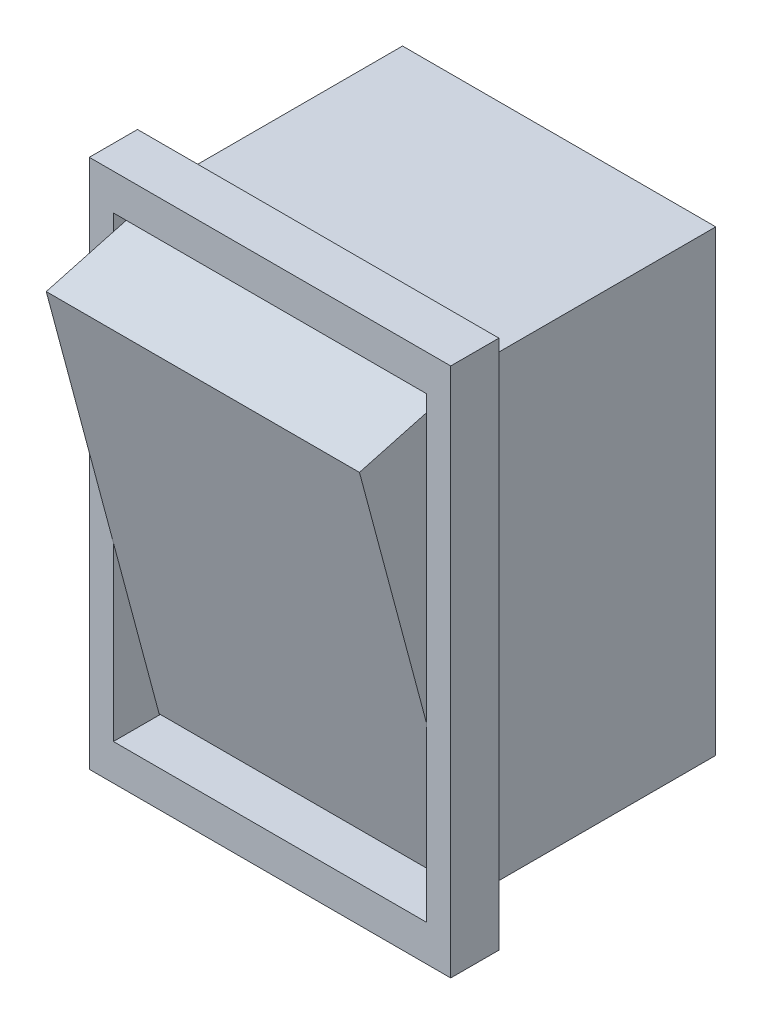
ISO-10303-21;
HEADER;
FILE_DESCRIPTION(('STEP AP214'),'2;1');
FILE_NAME('part.step','',(''),(''),'','','');
FILE_SCHEMA(('AUTOMOTIVE_DESIGN { 1 0 10303 214 1 1 1 1 }'));
ENDSEC;
DATA;
#1=APPLICATION_CONTEXT('core data for automotive mechanical design processes');
#2=APPLICATION_PROTOCOL_DEFINITION('international standard','automotive_design',2000,#1);
#3=PRODUCT_CONTEXT('',#1,'mechanical');
#4=PRODUCT('Part','Part','',(#3));
#5=PRODUCT_RELATED_PRODUCT_CATEGORY('part','',(#4));
#6=PRODUCT_DEFINITION_FORMATION('','',#4);
#7=PRODUCT_DEFINITION_CONTEXT('part definition',#1,'design');
#8=PRODUCT_DEFINITION('design','',#6,#7);
#9=PRODUCT_DEFINITION_SHAPE('','',#8);
#10=(LENGTH_UNIT() NAMED_UNIT(*) SI_UNIT(.MILLI.,.METRE.));
#11=(NAMED_UNIT(*) PLANE_ANGLE_UNIT() SI_UNIT($,.RADIAN.));
#12=(NAMED_UNIT(*) SI_UNIT($,.STERADIAN.) SOLID_ANGLE_UNIT());
#13=UNCERTAINTY_MEASURE_WITH_UNIT(LENGTH_MEASURE(1.E-05),#10,'distance_accuracy_value','');
#14=(GEOMETRIC_REPRESENTATION_CONTEXT(3) GLOBAL_UNCERTAINTY_ASSIGNED_CONTEXT((#13)) GLOBAL_UNIT_ASSIGNED_CONTEXT((#10,
#11,#12)) REPRESENTATION_CONTEXT('',''));
#15=CARTESIAN_POINT('',(0.,0.,0.));
#16=DIRECTION('',(0.,0.,1.));
#17=DIRECTION('',(1.,0.,0.));
#18=AXIS2_PLACEMENT_3D('',#15,#16,#17);
#19=CARTESIAN_POINT('',(-6.5,-9.5,12.));
#20=DIRECTION('',(1.,0.,0.));
#21=DIRECTION('',(0.,0.,-1.));
#22=AXIS2_PLACEMENT_3D('',#19,#20,#21);
#23=PLANE('',#22);
#24=DIRECTION('',(0.,1.,0.));
#25=VECTOR('',#24,1.);
#26=CARTESIAN_POINT('',(-6.5,-9.45001228834442,10.1028242124548));
#27=LINE('',#26,#25);
#28=CARTESIAN_POINT('',(-6.5,-9.45001228834442,10.1028242124548));
#29=VERTEX_POINT('',#28);
#30=CARTESIAN_POINT('',(-6.5,9.33792134068453,10.1028242124548));
#31=VERTEX_POINT('',#30);
#32=EDGE_CURVE('E153',#29,#31,#27,.T.);
#33=ORIENTED_EDGE('',*,*,#32,.F.);
#34=DIRECTION('',(0.,-0.966054260124425,-0.258339246912755));
#35=VECTOR('',#34,1.);
#36=CARTESIAN_POINT('',(-6.5,8.06740304725563,14.787277324927));
#37=LINE('',#36,#35);
#38=CARTESIAN_POINT('',(-6.5,-2.3555627470331,12.));
#39=VERTEX_POINT('',#38);
#40=EDGE_CURVE('E163',#39,#29,#37,.T.);
#41=ORIENTED_EDGE('',*,*,#40,.F.);
#42=DIRECTION('',(0.,-1.,0.));
#43=VECTOR('',#42,1.);
#44=CARTESIAN_POINT('',(-6.5,-9.5,12.));
#45=LINE('',#44,#43);
#46=CARTESIAN_POINT('',(-6.5,-9.5,12.));
#47=VERTEX_POINT('',#46);
#48=EDGE_CURVE('E180',#39,#47,#45,.T.);
#49=ORIENTED_EDGE('',*,*,#48,.T.);
#50=DIRECTION('',(0.,0.,-1.));
#51=VECTOR('',#50,1.);
#52=CARTESIAN_POINT('',(-6.5,-9.5,12.));
#53=LINE('',#52,#51);
#54=CARTESIAN_POINT('',(-6.5,-9.5,10.));
#55=VERTEX_POINT('',#54);
#56=EDGE_CURVE('E209',#47,#55,#53,.T.);
#57=ORIENTED_EDGE('',*,*,#56,.T.);
#58=DIRECTION('',(0.,-1.,0.));
#59=VECTOR('',#58,1.);
#60=CARTESIAN_POINT('',(-6.5,-9.5,10.));
#61=LINE('',#60,#59);
#62=CARTESIAN_POINT('',(-6.5,9.5,10.));
#63=VERTEX_POINT('',#62);
#64=EDGE_CURVE('E190',#63,#55,#61,.T.);
#65=ORIENTED_EDGE('',*,*,#64,.F.);
#66=DIRECTION('',(0.,0.,-1.));
#67=VECTOR('',#66,1.);
#68=CARTESIAN_POINT('',(-6.5,9.5,12.));
#69=LINE('',#68,#67);
#70=CARTESIAN_POINT('',(-6.5,9.5,12.));
#71=VERTEX_POINT('',#70);
#72=EDGE_CURVE('E189',#71,#63,#69,.T.);
#73=ORIENTED_EDGE('',*,*,#72,.F.);
#74=CARTESIAN_POINT('',(-6.5,8.82336895088497,12.));
#75=VERTEX_POINT('',#74);
#76=EDGE_CURVE('E162',#71,#75,#45,.T.);
#77=ORIENTED_EDGE('',*,*,#76,.T.);
#78=DIRECTION('',(0.,-0.261763317111545,0.965132097598438));
#79=VECTOR('',#78,1.);
#80=CARTESIAN_POINT('',(-6.5,9.33792134068453,10.1028242124548));
#81=LINE('',#80,#79);
#82=EDGE_CURVE('E145',#31,#75,#81,.T.);
#83=ORIENTED_EDGE('',*,*,#82,.F.);
#84=EDGE_LOOP('',(#33,#41,#49,#57,#65,#73,#77,#83));
#85=FACE_BOUND('',#84,.T.);
#86=ADVANCED_FACE('F49',(#85),#23,.T.);
#87=CARTESIAN_POINT('',(6.5,-9.5,12.));
#88=DIRECTION('',(-1.,0.,0.));
#89=DIRECTION('',(0.,0.,1.));
#90=AXIS2_PLACEMENT_3D('',#87,#88,#89);
#91=PLANE('',#90);
#92=DIRECTION('',(0.,1.,0.));
#93=VECTOR('',#92,1.);
#94=CARTESIAN_POINT('',(6.5,-9.5,12.));
#95=LINE('',#94,#93);
#96=CARTESIAN_POINT('',(6.5,-9.5,12.));
#97=VERTEX_POINT('',#96);
#98=CARTESIAN_POINT('',(6.5,-2.3555627470331,12.));
#99=VERTEX_POINT('',#98);
#100=EDGE_CURVE('E183',#97,#99,#95,.T.);
#101=ORIENTED_EDGE('',*,*,#100,.T.);
#102=DIRECTION('',(0.,0.966054260124425,0.258339246912755));
#103=VECTOR('',#102,1.);
#104=CARTESIAN_POINT('',(6.5,8.06740304725563,14.787277324927));
#105=LINE('',#104,#103);
#106=CARTESIAN_POINT('',(6.5,-9.45001228834442,10.1028242124548));
#107=VERTEX_POINT('',#106);
#108=EDGE_CURVE('E173',#107,#99,#105,.T.);
#109=ORIENTED_EDGE('',*,*,#108,.F.);
#110=DIRECTION('',(0.,-1.,0.));
#111=VECTOR('',#110,1.);
#112=CARTESIAN_POINT('',(6.5,-9.45001228834442,10.1028242124548));
#113=LINE('',#112,#111);
#114=CARTESIAN_POINT('',(6.5,9.33792134068453,10.1028242124548));
#115=VERTEX_POINT('',#114);
#116=EDGE_CURVE('E194',#115,#107,#113,.T.);
#117=ORIENTED_EDGE('',*,*,#116,.F.);
#118=DIRECTION('',(0.,-0.261763317111545,0.965132097598438));
#119=VECTOR('',#118,1.);
#120=CARTESIAN_POINT('',(6.5,7.56785108398158,16.6291459239891));
#121=LINE('',#120,#119);
#122=CARTESIAN_POINT('',(6.5,8.82336895088497,12.));
#123=VERTEX_POINT('',#122);
#124=EDGE_CURVE('E12',#115,#123,#121,.T.);
#125=ORIENTED_EDGE('',*,*,#124,.T.);
#126=CARTESIAN_POINT('',(6.5,9.5,12.));
#127=VERTEX_POINT('',#126);
#128=EDGE_CURVE('E182',#123,#127,#95,.T.);
#129=ORIENTED_EDGE('',*,*,#128,.T.);
#130=DIRECTION('',(0.,0.,-1.));
#131=VECTOR('',#130,1.);
#132=CARTESIAN_POINT('',(6.5,9.5,12.));
#133=LINE('',#132,#131);
#134=CARTESIAN_POINT('',(6.5,9.5,10.));
#135=VERTEX_POINT('',#134);
#136=EDGE_CURVE('E205',#127,#135,#133,.T.);
#137=ORIENTED_EDGE('',*,*,#136,.T.);
#138=DIRECTION('',(0.,1.,0.));
#139=VECTOR('',#138,1.);
#140=CARTESIAN_POINT('',(6.5,-9.5,10.));
#141=LINE('',#140,#139);
#142=CARTESIAN_POINT('',(6.5,-9.5,10.));
#143=VERTEX_POINT('',#142);
#144=EDGE_CURVE('E197',#143,#135,#141,.T.);
#145=ORIENTED_EDGE('',*,*,#144,.F.);
#146=DIRECTION('',(0.,0.,-1.));
#147=VECTOR('',#146,1.);
#148=CARTESIAN_POINT('',(6.5,-9.5,12.));
#149=LINE('',#148,#147);
#150=EDGE_CURVE('E207',#97,#143,#149,.T.);
#151=ORIENTED_EDGE('',*,*,#150,.F.);
#152=EDGE_LOOP('',(#101,#109,#117,#125,#129,#137,#145,#151));
#153=FACE_BOUND('',#152,.T.);
#154=ADVANCED_FACE('F263',(#153),#91,.T.);
#155=CARTESIAN_POINT('',(0.,0.,12.));
#156=DIRECTION('',(0.,0.,-1.));
#157=DIRECTION('',(-1.,0.,0.));
#158=AXIS2_PLACEMENT_3D('',#155,#156,#157);
#159=PLANE('',#158);
#160=DIRECTION('',(0.,1.,0.));
#161=VECTOR('',#160,1.);
#162=CARTESIAN_POINT('',(7.5,-11.,12.));
#163=LINE('',#162,#161);
#164=CARTESIAN_POINT('',(7.5,-11.,12.));
#165=VERTEX_POINT('',#164);
#166=CARTESIAN_POINT('',(7.5,11.,12.));
#167=VERTEX_POINT('',#166);
#168=EDGE_CURVE('E213',#165,#167,#163,.T.);
#169=ORIENTED_EDGE('',*,*,#168,.T.);
#170=DIRECTION('',(-1.,0.,0.));
#171=VECTOR('',#170,1.);
#172=CARTESIAN_POINT('',(-7.5,11.,12.));
#173=LINE('',#172,#171);
#174=CARTESIAN_POINT('',(-7.5,11.,12.));
#175=VERTEX_POINT('',#174);
#176=EDGE_CURVE('E216',#167,#175,#173,.T.);
#177=ORIENTED_EDGE('',*,*,#176,.T.);
#178=DIRECTION('',(0.,-1.,0.));
#179=VECTOR('',#178,1.);
#180=CARTESIAN_POINT('',(-7.5,-11.,12.));
#181=LINE('',#180,#179);
#182=CARTESIAN_POINT('',(-7.5,-11.,12.));
#183=VERTEX_POINT('',#182);
#184=EDGE_CURVE('E219',#175,#183,#181,.T.);
#185=ORIENTED_EDGE('',*,*,#184,.T.);
#186=DIRECTION('',(1.,0.,0.));
#187=VECTOR('',#186,1.);
#188=CARTESIAN_POINT('',(-7.5,-11.,12.));
#189=LINE('',#188,#187);
#190=EDGE_CURVE('E221',#183,#165,#189,.T.);
#191=ORIENTED_EDGE('',*,*,#190,.T.);
#192=EDGE_LOOP('',(#169,#177,#185,#191));
#193=FACE_BOUND('',#192,.T.);
#194=ORIENTED_EDGE('',*,*,#76,.F.);
#195=DIRECTION('',(-1.,0.,0.));
#196=VECTOR('',#195,1.);
#197=CARTESIAN_POINT('',(6.5,9.5,12.));
#198=LINE('',#197,#196);
#199=EDGE_CURVE('E186',#127,#71,#198,.T.);
#200=ORIENTED_EDGE('',*,*,#199,.F.);
#201=ORIENTED_EDGE('',*,*,#128,.F.);
#202=EDGE_CURVE('E187',#99,#123,#95,.T.);
#203=ORIENTED_EDGE('',*,*,#202,.F.);
#204=ORIENTED_EDGE('',*,*,#100,.F.);
#205=DIRECTION('',(1.,0.,0.));
#206=VECTOR('',#205,1.);
#207=CARTESIAN_POINT('',(6.5,-9.5,12.));
#208=LINE('',#207,#206);
#209=EDGE_CURVE('E178',#47,#97,#208,.T.);
#210=ORIENTED_EDGE('',*,*,#209,.F.);
#211=ORIENTED_EDGE('',*,*,#48,.F.);
#212=EDGE_CURVE('E179',#75,#39,#45,.T.);
#213=ORIENTED_EDGE('',*,*,#212,.F.);
#214=EDGE_LOOP('',(#194,#200,#201,#203,#204,#210,#211,#213));
#215=FACE_BOUND('',#214,.T.);
#216=ADVANCED_FACE('F260',(#193,#215),#159,.F.);
#217=CARTESIAN_POINT('',(0.,0.,10.));
#218=DIRECTION('',(0.,0.,-1.));
#219=DIRECTION('',(-1.,0.,0.));
#220=AXIS2_PLACEMENT_3D('',#217,#218,#219);
#221=PLANE('',#220);
#222=DIRECTION('',(0.,1.,0.));
#223=VECTOR('',#222,1.);
#224=CARTESIAN_POINT('',(7.5,-11.,10.));
#225=LINE('',#224,#223);
#226=CARTESIAN_POINT('',(7.5,-11.,10.));
#227=VERTEX_POINT('',#226);
#228=CARTESIAN_POINT('',(7.5,11.,10.));
#229=VERTEX_POINT('',#228);
#230=EDGE_CURVE('E212',#227,#229,#225,.T.);
#231=ORIENTED_EDGE('',*,*,#230,.F.);
#232=DIRECTION('',(1.,0.,0.));
#233=VECTOR('',#232,1.);
#234=CARTESIAN_POINT('',(-7.5,-11.,10.));
#235=LINE('',#234,#233);
#236=CARTESIAN_POINT('',(-7.5,-11.,10.));
#237=VERTEX_POINT('',#236);
#238=EDGE_CURVE('E217',#237,#227,#235,.T.);
#239=ORIENTED_EDGE('',*,*,#238,.F.);
#240=DIRECTION('',(0.,-1.,0.));
#241=VECTOR('',#240,1.);
#242=CARTESIAN_POINT('',(-7.5,-11.,10.));
#243=LINE('',#242,#241);
#244=CARTESIAN_POINT('',(-7.5,11.,10.));
#245=VERTEX_POINT('',#244);
#246=EDGE_CURVE('E228',#245,#237,#243,.T.);
#247=ORIENTED_EDGE('',*,*,#246,.F.);
#248=DIRECTION('',(-1.,0.,0.));
#249=VECTOR('',#248,1.);
#250=CARTESIAN_POINT('',(-7.5,11.,10.));
#251=LINE('',#250,#249);
#252=EDGE_CURVE('E226',#229,#245,#251,.T.);
#253=ORIENTED_EDGE('',*,*,#252,.F.);
#254=EDGE_LOOP('',(#231,#239,#247,#253));
#255=FACE_BOUND('',#254,.T.);
#256=DIRECTION('',(-1.,0.,0.));
#257=VECTOR('',#256,1.);
#258=CARTESIAN_POINT('',(6.5,9.5,10.));
#259=LINE('',#258,#257);
#260=EDGE_CURVE('E200',#135,#63,#259,.T.);
#261=ORIENTED_EDGE('',*,*,#260,.T.);
#262=ORIENTED_EDGE('',*,*,#64,.T.);
#263=DIRECTION('',(1.,0.,0.));
#264=VECTOR('',#263,1.);
#265=CARTESIAN_POINT('',(6.5,-9.5,10.));
#266=LINE('',#265,#264);
#267=EDGE_CURVE('E193',#55,#143,#266,.T.);
#268=ORIENTED_EDGE('',*,*,#267,.T.);
#269=ORIENTED_EDGE('',*,*,#144,.T.);
#270=EDGE_LOOP('',(#261,#262,#268,#269));
#271=FACE_BOUND('',#270,.T.);
#272=ADVANCED_FACE('F249',(#255,#271),#221,.T.);
#273=CARTESIAN_POINT('',(7.5,-11.,12.));
#274=DIRECTION('',(-1.,0.,0.));
#275=DIRECTION('',(0.,0.,1.));
#276=AXIS2_PLACEMENT_3D('',#273,#274,#275);
#277=PLANE('',#276);
#278=ORIENTED_EDGE('',*,*,#230,.T.);
#279=DIRECTION('',(0.,0.,-1.));
#280=VECTOR('',#279,1.);
#281=CARTESIAN_POINT('',(7.5,11.,12.));
#282=LINE('',#281,#280);
#283=EDGE_CURVE('E57',#167,#229,#282,.T.);
#284=ORIENTED_EDGE('',*,*,#283,.F.);
#285=ORIENTED_EDGE('',*,*,#168,.F.);
#286=DIRECTION('',(0.,0.,-1.));
#287=VECTOR('',#286,1.);
#288=CARTESIAN_POINT('',(7.5,-11.,12.));
#289=LINE('',#288,#287);
#290=EDGE_CURVE('E223',#165,#227,#289,.T.);
#291=ORIENTED_EDGE('',*,*,#290,.T.);
#292=EDGE_LOOP('',(#278,#284,#285,#291));
#293=FACE_BOUND('',#292,.T.);
#294=ADVANCED_FACE('F51',(#293),#277,.F.);
#295=CARTESIAN_POINT('',(-7.5,11.,12.));
#296=DIRECTION('',(0.,-1.,0.));
#297=DIRECTION('',(0.,0.,-1.));
#298=AXIS2_PLACEMENT_3D('',#295,#296,#297);
#299=PLANE('',#298);
#300=ORIENTED_EDGE('',*,*,#252,.T.);
#301=DIRECTION('',(0.,0.,-1.));
#302=VECTOR('',#301,1.);
#303=CARTESIAN_POINT('',(-7.5,11.,12.));
#304=LINE('',#303,#302);
#305=EDGE_CURVE('E236',#175,#245,#304,.T.);
#306=ORIENTED_EDGE('',*,*,#305,.F.);
#307=ORIENTED_EDGE('',*,*,#176,.F.);
#308=ORIENTED_EDGE('',*,*,#283,.T.);
#309=EDGE_LOOP('',(#300,#306,#307,#308));
#310=FACE_BOUND('',#309,.T.);
#311=ADVANCED_FACE('F241',(#310),#299,.F.);
#312=CARTESIAN_POINT('',(-7.5,-11.,12.));
#313=DIRECTION('',(1.,0.,0.));
#314=DIRECTION('',(0.,0.,-1.));
#315=AXIS2_PLACEMENT_3D('',#312,#313,#314);
#316=PLANE('',#315);
#317=ORIENTED_EDGE('',*,*,#246,.T.);
#318=DIRECTION('',(0.,0.,-1.));
#319=VECTOR('',#318,1.);
#320=CARTESIAN_POINT('',(-7.5,-11.,12.));
#321=LINE('',#320,#319);
#322=EDGE_CURVE('E233',#183,#237,#321,.T.);
#323=ORIENTED_EDGE('',*,*,#322,.F.);
#324=ORIENTED_EDGE('',*,*,#184,.F.);
#325=ORIENTED_EDGE('',*,*,#305,.T.);
#326=EDGE_LOOP('',(#317,#323,#324,#325));
#327=FACE_BOUND('',#326,.T.);
#328=ADVANCED_FACE('F254',(#327),#316,.F.);
#329=CARTESIAN_POINT('',(-7.5,-11.,12.));
#330=DIRECTION('',(0.,1.,0.));
#331=DIRECTION('',(0.,0.,1.));
#332=AXIS2_PLACEMENT_3D('',#329,#330,#331);
#333=PLANE('',#332);
#334=ORIENTED_EDGE('',*,*,#238,.T.);
#335=ORIENTED_EDGE('',*,*,#290,.F.);
#336=ORIENTED_EDGE('',*,*,#190,.F.);
#337=ORIENTED_EDGE('',*,*,#322,.T.);
#338=EDGE_LOOP('',(#334,#335,#336,#337));
#339=FACE_BOUND('',#338,.T.);
#340=ADVANCED_FACE('F258',(#339),#333,.F.);
#341=CARTESIAN_POINT('',(6.5,-9.5,12.));
#342=DIRECTION('',(0.,1.,0.));
#343=DIRECTION('',(0.,0.,1.));
#344=AXIS2_PLACEMENT_3D('',#341,#342,#343);
#345=PLANE('',#344);
#346=ORIENTED_EDGE('',*,*,#267,.F.);
#347=ORIENTED_EDGE('',*,*,#56,.F.);
#348=ORIENTED_EDGE('',*,*,#209,.T.);
#349=ORIENTED_EDGE('',*,*,#150,.T.);
#350=EDGE_LOOP('',(#346,#347,#348,#349));
#351=FACE_BOUND('',#350,.T.);
#352=ADVANCED_FACE('F273',(#351),#345,.T.);
#353=CARTESIAN_POINT('',(6.5,9.5,12.));
#354=DIRECTION('',(0.,-1.,0.));
#355=DIRECTION('',(0.,0.,-1.));
#356=AXIS2_PLACEMENT_3D('',#353,#354,#355);
#357=PLANE('',#356);
#358=ORIENTED_EDGE('',*,*,#260,.F.);
#359=ORIENTED_EDGE('',*,*,#136,.F.);
#360=ORIENTED_EDGE('',*,*,#199,.T.);
#361=ORIENTED_EDGE('',*,*,#72,.T.);
#362=EDGE_LOOP('',(#358,#359,#360,#361));
#363=FACE_BOUND('',#362,.T.);
#364=ADVANCED_FACE('F283',(#363),#357,.T.);
#365=CARTESIAN_POINT('',(-6.5,0.,0.));
#366=DIRECTION('',(1.,0.,0.));
#367=DIRECTION('',(0.,0.,-1.));
#368=AXIS2_PLACEMENT_3D('',#365,#366,#367);
#369=PLANE('',#368);
#370=CARTESIAN_POINT('',(-6.5,8.06740304725563,14.787277324927));
#371=VERTEX_POINT('',#370);
#372=EDGE_CURVE('E157',#75,#371,#81,.T.);
#373=ORIENTED_EDGE('',*,*,#372,.F.);
#374=ORIENTED_EDGE('',*,*,#212,.T.);
#375=EDGE_CURVE('E165',#371,#39,#37,.T.);
#376=ORIENTED_EDGE('',*,*,#375,.F.);
#377=EDGE_LOOP('',(#373,#374,#376));
#378=FACE_BOUND('',#377,.T.);
#379=ADVANCED_FACE('F285',(#378),#369,.F.);
#380=CARTESIAN_POINT('',(6.5,-9.5,12.));
#381=DIRECTION('',(-1.,0.,0.));
#382=DIRECTION('',(0.,0.,1.));
#383=AXIS2_PLACEMENT_3D('',#380,#381,#382);
#384=PLANE('',#383);
#385=CARTESIAN_POINT('',(6.5,8.06740304725563,14.787277324927));
#386=VERTEX_POINT('',#385);
#387=EDGE_CURVE('E149',#99,#386,#105,.T.);
#388=ORIENTED_EDGE('',*,*,#387,.F.);
#389=ORIENTED_EDGE('',*,*,#202,.T.);
#390=DIRECTION('',(0.,0.261763317111545,-0.965132097598438));
#391=VECTOR('',#390,1.);
#392=CARTESIAN_POINT('',(6.5,9.33792134068453,10.1028242124548));
#393=LINE('',#392,#391);
#394=EDGE_CURVE('E176',#386,#123,#393,.T.);
#395=ORIENTED_EDGE('',*,*,#394,.F.);
#396=EDGE_LOOP('',(#388,#389,#395));
#397=FACE_BOUND('',#396,.T.);
#398=ADVANCED_FACE('F291',(#397),#384,.F.);
#399=CARTESIAN_POINT('',(25.863123482841,8.06740304725563,14.787277324927));
#400=DIRECTION('',(0.,0.258339246912755,-0.966054260124425));
#401=DIRECTION('',(0.,0.966054260124425,0.258339246912755));
#402=AXIS2_PLACEMENT_3D('',#399,#400,#401);
#403=PLANE('',#402);
#404=DIRECTION('',(-1.,0.,0.));
#405=VECTOR('',#404,1.);
#406=CARTESIAN_POINT('',(25.863123482841,-9.45001228834442,10.1028242124548));
#407=LINE('',#406,#405);
#408=EDGE_CURVE('E64',#107,#29,#407,.T.);
#409=ORIENTED_EDGE('',*,*,#408,.F.);
#410=ORIENTED_EDGE('',*,*,#108,.T.);
#411=ORIENTED_EDGE('',*,*,#387,.T.);
#412=DIRECTION('',(-1.,0.,0.));
#413=VECTOR('',#412,1.);
#414=CARTESIAN_POINT('',(25.863123482841,8.06740304725563,14.787277324927));
#415=LINE('',#414,#413);
#416=EDGE_CURVE('E150',#386,#371,#415,.T.);
#417=ORIENTED_EDGE('',*,*,#416,.T.);
#418=ORIENTED_EDGE('',*,*,#375,.T.);
#419=ORIENTED_EDGE('',*,*,#40,.T.);
#420=EDGE_LOOP('',(#409,#410,#411,#417,#418,#419));
#421=FACE_BOUND('',#420,.T.);
#422=ADVANCED_FACE('F376',(#421),#403,.F.);
#423=CARTESIAN_POINT('',(25.863123482841,9.33792134068453,10.1028242124548));
#424=DIRECTION('',(0.,-0.965132097598438,-0.261763317111546));
#425=DIRECTION('',(0.,0.261763317111545,-0.965132097598438));
#426=AXIS2_PLACEMENT_3D('',#423,#424,#425);
#427=PLANE('',#426);
#428=ORIENTED_EDGE('',*,*,#416,.F.);
#429=ORIENTED_EDGE('',*,*,#394,.T.);
#430=ORIENTED_EDGE('',*,*,#124,.F.);
#431=DIRECTION('',(-1.,0.,0.));
#432=VECTOR('',#431,1.);
#433=CARTESIAN_POINT('',(25.863123482841,9.33792134068453,10.1028242124548));
#434=LINE('',#433,#432);
#435=EDGE_CURVE('E69',#115,#31,#434,.T.);
#436=ORIENTED_EDGE('',*,*,#435,.T.);
#437=ORIENTED_EDGE('',*,*,#82,.T.);
#438=ORIENTED_EDGE('',*,*,#372,.T.);
#439=EDGE_LOOP('',(#428,#429,#430,#436,#437,#438));
#440=FACE_BOUND('',#439,.T.);
#441=ADVANCED_FACE('F143',(#440),#427,.F.);
#442=CARTESIAN_POINT('',(25.863123482841,-9.45001228834442,10.1028242124548));
#443=DIRECTION('',(0.,0.,1.));
#444=DIRECTION('',(1.,0.,0.));
#445=AXIS2_PLACEMENT_3D('',#442,#443,#444);
#446=PLANE('',#445);
#447=ORIENTED_EDGE('',*,*,#435,.F.);
#448=ORIENTED_EDGE('',*,*,#116,.T.);
#449=ORIENTED_EDGE('',*,*,#408,.T.);
#450=ORIENTED_EDGE('',*,*,#32,.T.);
#451=EDGE_LOOP('',(#447,#448,#449,#450));
#452=FACE_BOUND('',#451,.T.);
#453=ADVANCED_FACE('F154',(#452),#446,.F.);
#454=CLOSED_SHELL('',(#86,#154,#216,#272,#294,#311,#328,#340,#352,#364,#379,#398,#422,#441,#453));
#455=MANIFOLD_SOLID_BREP('B2',#454);
#456=CARTESIAN_POINT('',(6.5,-9.5,10.));
#457=DIRECTION('',(-1.,0.,0.));
#458=DIRECTION('',(0.,0.,1.));
#459=AXIS2_PLACEMENT_3D('',#456,#457,#458);
#460=PLANE('',#459);
#461=DIRECTION('',(0.,1.,0.));
#462=VECTOR('',#461,1.);
#463=CARTESIAN_POINT('',(6.5,-9.5,0.));
#464=LINE('',#463,#462);
#465=CARTESIAN_POINT('',(6.5,-9.5,0.));
#466=VERTEX_POINT('',#465);
#467=CARTESIAN_POINT('',(6.5,9.5,0.));
#468=VERTEX_POINT('',#467);
#469=EDGE_CURVE('E478',#466,#468,#464,.T.);
#470=ORIENTED_EDGE('',*,*,#469,.T.);
#471=DIRECTION('',(0.,0.,-1.));
#472=VECTOR('',#471,1.);
#473=CARTESIAN_POINT('',(6.5,9.5,10.));
#474=LINE('',#473,#472);
#475=CARTESIAN_POINT('',(6.5,9.5,10.));
#476=VERTEX_POINT('',#475);
#477=EDGE_CURVE('E47',#476,#468,#474,.T.);
#478=ORIENTED_EDGE('',*,*,#477,.F.);
#479=DIRECTION('',(0.,1.,0.));
#480=VECTOR('',#479,1.);
#481=CARTESIAN_POINT('',(6.5,-9.5,10.));
#482=LINE('',#481,#480);
#483=CARTESIAN_POINT('',(6.5,-9.5,10.));
#484=VERTEX_POINT('',#483);
#485=EDGE_CURVE('E462',#484,#476,#482,.T.);
#486=ORIENTED_EDGE('',*,*,#485,.F.);
#487=DIRECTION('',(0.,0.,-1.));
#488=VECTOR('',#487,1.);
#489=CARTESIAN_POINT('',(6.5,-9.5,10.));
#490=LINE('',#489,#488);
#491=EDGE_CURVE('E474',#484,#466,#490,.T.);
#492=ORIENTED_EDGE('',*,*,#491,.T.);
#493=EDGE_LOOP('',(#470,#478,#486,#492));
#494=FACE_BOUND('',#493,.T.);
#495=ADVANCED_FACE('F410',(#494),#460,.F.);
#496=CARTESIAN_POINT('',(-6.5,9.5,10.));
#497=DIRECTION('',(0.,-1.,0.));
#498=DIRECTION('',(0.,0.,-1.));
#499=AXIS2_PLACEMENT_3D('',#496,#497,#498);
#500=PLANE('',#499);
#501=DIRECTION('',(-1.,0.,0.));
#502=VECTOR('',#501,1.);
#503=CARTESIAN_POINT('',(-6.5,9.5,0.));
#504=LINE('',#503,#502);
#505=CARTESIAN_POINT('',(-6.5,9.5,0.));
#506=VERTEX_POINT('',#505);
#507=EDGE_CURVE('E467',#468,#506,#504,.T.);
#508=ORIENTED_EDGE('',*,*,#507,.T.);
#509=DIRECTION('',(0.,0.,-1.));
#510=VECTOR('',#509,1.);
#511=CARTESIAN_POINT('',(-6.5,9.5,10.));
#512=LINE('',#511,#510);
#513=CARTESIAN_POINT('',(-6.5,9.5,10.));
#514=VERTEX_POINT('',#513);
#515=EDGE_CURVE('E419',#514,#506,#512,.T.);
#516=ORIENTED_EDGE('',*,*,#515,.F.);
#517=DIRECTION('',(-1.,0.,0.));
#518=VECTOR('',#517,1.);
#519=CARTESIAN_POINT('',(-6.5,9.5,10.));
#520=LINE('',#519,#518);
#521=EDGE_CURVE('E457',#476,#514,#520,.T.);
#522=ORIENTED_EDGE('',*,*,#521,.F.);
#523=ORIENTED_EDGE('',*,*,#477,.T.);
#524=EDGE_LOOP('',(#508,#516,#522,#523));
#525=FACE_BOUND('',#524,.T.);
#526=ADVANCED_FACE('F466',(#525),#500,.F.);
#527=CARTESIAN_POINT('',(-6.5,-9.5,10.));
#528=DIRECTION('',(1.,0.,0.));
#529=DIRECTION('',(0.,0.,-1.));
#530=AXIS2_PLACEMENT_3D('',#527,#528,#529);
#531=PLANE('',#530);
#532=DIRECTION('',(0.,-1.,0.));
#533=VECTOR('',#532,1.);
#534=CARTESIAN_POINT('',(-6.5,-9.5,0.));
#535=LINE('',#534,#533);
#536=CARTESIAN_POINT('',(-6.5,-9.5,0.));
#537=VERTEX_POINT('',#536);
#538=EDGE_CURVE('E444',#506,#537,#535,.T.);
#539=ORIENTED_EDGE('',*,*,#538,.T.);
#540=DIRECTION('',(0.,0.,-1.));
#541=VECTOR('',#540,1.);
#542=CARTESIAN_POINT('',(-6.5,-9.5,10.));
#543=LINE('',#542,#541);
#544=CARTESIAN_POINT('',(-6.5,-9.5,10.));
#545=VERTEX_POINT('',#544);
#546=EDGE_CURVE('E469',#545,#537,#543,.T.);
#547=ORIENTED_EDGE('',*,*,#546,.F.);
#548=DIRECTION('',(0.,-1.,0.));
#549=VECTOR('',#548,1.);
#550=CARTESIAN_POINT('',(-6.5,-9.5,10.));
#551=LINE('',#550,#549);
#552=EDGE_CURVE('E460',#514,#545,#551,.T.);
#553=ORIENTED_EDGE('',*,*,#552,.F.);
#554=ORIENTED_EDGE('',*,*,#515,.T.);
#555=EDGE_LOOP('',(#539,#547,#553,#554));
#556=FACE_BOUND('',#555,.T.);
#557=ADVANCED_FACE('F470',(#556),#531,.F.);
#558=CARTESIAN_POINT('',(-6.5,-9.5,10.));
#559=DIRECTION('',(0.,1.,0.));
#560=DIRECTION('',(0.,0.,1.));
#561=AXIS2_PLACEMENT_3D('',#558,#559,#560);
#562=PLANE('',#561);
#563=DIRECTION('',(1.,0.,0.));
#564=VECTOR('',#563,1.);
#565=CARTESIAN_POINT('',(-6.5,-9.5,0.));
#566=LINE('',#565,#564);
#567=EDGE_CURVE('E450',#537,#466,#566,.T.);
#568=ORIENTED_EDGE('',*,*,#567,.T.);
#569=ORIENTED_EDGE('',*,*,#491,.F.);
#570=DIRECTION('',(1.,0.,0.));
#571=VECTOR('',#570,1.);
#572=CARTESIAN_POINT('',(-6.5,-9.5,10.));
#573=LINE('',#572,#571);
#574=EDGE_CURVE('E427',#545,#484,#573,.T.);
#575=ORIENTED_EDGE('',*,*,#574,.F.);
#576=ORIENTED_EDGE('',*,*,#546,.T.);
#577=EDGE_LOOP('',(#568,#569,#575,#576));
#578=FACE_BOUND('',#577,.T.);
#579=ADVANCED_FACE('F491',(#578),#562,.F.);
#580=CARTESIAN_POINT('',(0.,0.,10.));
#581=DIRECTION('',(0.,0.,-1.));
#582=DIRECTION('',(-1.,0.,0.));
#583=AXIS2_PLACEMENT_3D('',#580,#581,#582);
#584=PLANE('',#583);
#585=ORIENTED_EDGE('',*,*,#485,.T.);
#586=ORIENTED_EDGE('',*,*,#521,.T.);
#587=ORIENTED_EDGE('',*,*,#552,.T.);
#588=ORIENTED_EDGE('',*,*,#574,.T.);
#589=EDGE_LOOP('',(#585,#586,#587,#588));
#590=FACE_BOUND('',#589,.T.);
#591=ADVANCED_FACE('F458',(#590),#584,.F.);
#592=CARTESIAN_POINT('',(0.,0.,0.));
#593=DIRECTION('',(0.,0.,-1.));
#594=DIRECTION('',(-1.,0.,0.));
#595=AXIS2_PLACEMENT_3D('',#592,#593,#594);
#596=PLANE('',#595);
#597=ORIENTED_EDGE('',*,*,#469,.F.);
#598=ORIENTED_EDGE('',*,*,#567,.F.);
#599=ORIENTED_EDGE('',*,*,#538,.F.);
#600=ORIENTED_EDGE('',*,*,#507,.F.);
#601=EDGE_LOOP('',(#597,#598,#599,#600));
#602=FACE_BOUND('',#601,.T.);
#603=ADVANCED_FACE('F494',(#602),#596,.T.);
#604=CLOSED_SHELL('',(#495,#526,#557,#579,#591,#603));
#605=MANIFOLD_SOLID_BREP('B6',#604);
#606=ADVANCED_BREP_SHAPE_REPRESENTATION('',(#18,#455,#605),#14);
#607=SHAPE_DEFINITION_REPRESENTATION(#9,#606);
ENDSEC;
END-ISO-10303-21;
